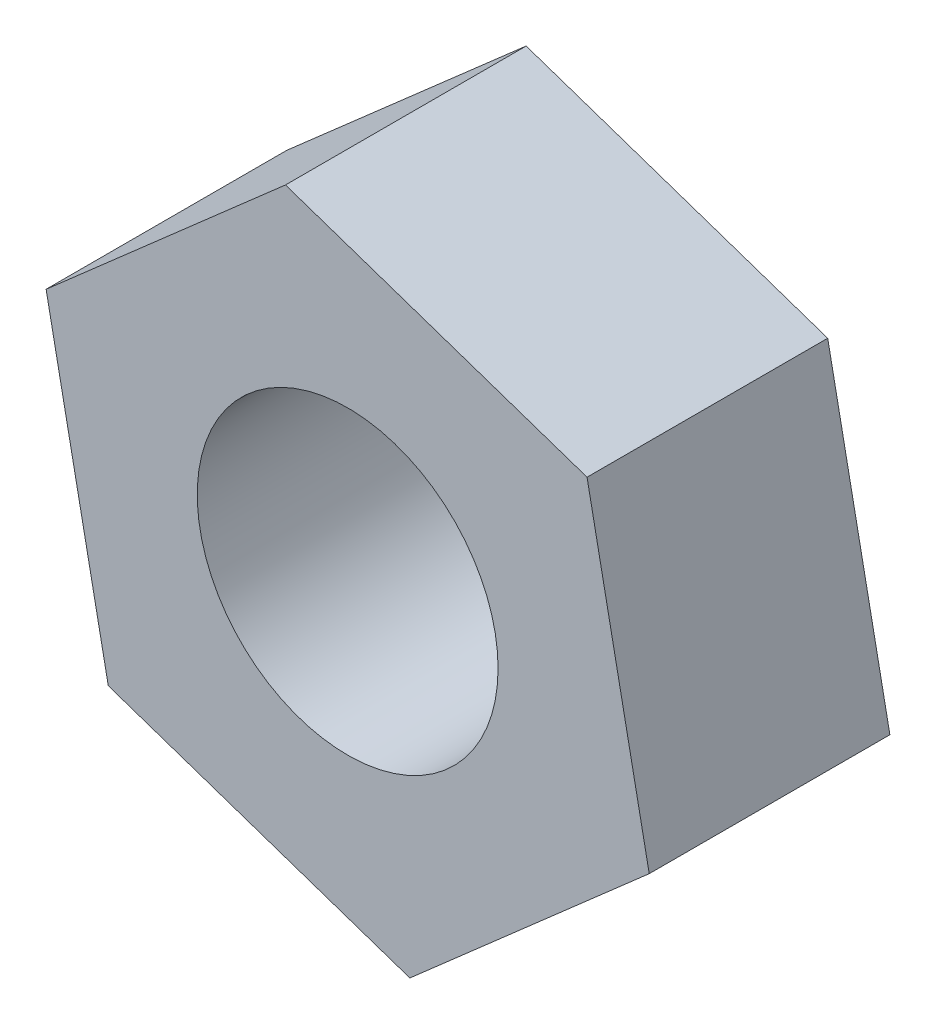
ISO-10303-21;
HEADER;
FILE_DESCRIPTION(('STEP AP214'),'2;1');
FILE_NAME('part.step','',(''),(''),'','','');
FILE_SCHEMA(('AUTOMOTIVE_DESIGN { 1 0 10303 214 1 1 1 1 }'));
ENDSEC;
DATA;
#1=APPLICATION_CONTEXT('core data for automotive mechanical design processes');
#2=APPLICATION_PROTOCOL_DEFINITION('international standard','automotive_design',2000,#1);
#3=PRODUCT_CONTEXT('',#1,'mechanical');
#4=PRODUCT('Part','Part','',(#3));
#5=PRODUCT_RELATED_PRODUCT_CATEGORY('part','',(#4));
#6=PRODUCT_DEFINITION_FORMATION('','',#4);
#7=PRODUCT_DEFINITION_CONTEXT('part definition',#1,'design');
#8=PRODUCT_DEFINITION('design','',#6,#7);
#9=PRODUCT_DEFINITION_SHAPE('','',#8);
#10=(LENGTH_UNIT() NAMED_UNIT(*) SI_UNIT(.MILLI.,.METRE.));
#11=(NAMED_UNIT(*) PLANE_ANGLE_UNIT() SI_UNIT($,.RADIAN.));
#12=(NAMED_UNIT(*) SI_UNIT($,.STERADIAN.) SOLID_ANGLE_UNIT());
#13=UNCERTAINTY_MEASURE_WITH_UNIT(LENGTH_MEASURE(1.E-05),#10,'distance_accuracy_value','');
#14=(GEOMETRIC_REPRESENTATION_CONTEXT(3) GLOBAL_UNCERTAINTY_ASSIGNED_CONTEXT((#13)) GLOBAL_UNIT_ASSIGNED_CONTEXT((#10,
#11,#12)) REPRESENTATION_CONTEXT('',''));
#15=CARTESIAN_POINT('',(0.,0.,0.));
#16=DIRECTION('',(0.,0.,1.));
#17=DIRECTION('',(1.,0.,0.));
#18=AXIS2_PLACEMENT_3D('',#15,#16,#17);
#19=CARTESIAN_POINT('',(0.,0.,2.4));
#20=DIRECTION('',(0.,0.,1.));
#21=DIRECTION('',(1.,0.,0.));
#22=AXIS2_PLACEMENT_3D('',#19,#20,#21);
#23=PLANE('',#22);
#24=DIRECTION('',(0.751714336104161,0.659488860327057,0.));
#25=VECTOR('',#24,1.);
#26=CARTESIAN_POINT('',(0.620087561564956,-3.11429361963925,2.4));
#27=LINE('',#26,#25);
#28=CARTESIAN_POINT('',(0.620087561564956,-3.11429361963925,2.4));
#29=VERTEX_POINT('',#28);
#30=CARTESIAN_POINT('',(3.00710117023386,-1.02013522893363,2.4));
#31=VERTEX_POINT('',#30);
#32=EDGE_CURVE('E130',#29,#31,#27,.T.);
#33=ORIENTED_EDGE('',*,*,#32,.T.);
#34=DIRECTION('',(-0.195276938503999,0.980748141618686,0.));
#35=VECTOR('',#34,1.);
#36=CARTESIAN_POINT('',(3.00710117023386,-1.02013522893363,2.4));
#37=LINE('',#36,#35);
#38=CARTESIAN_POINT('',(2.38701360866891,2.09415839070562,2.4));
#39=VERTEX_POINT('',#38);
#40=EDGE_CURVE('E88',#31,#39,#37,.T.);
#41=ORIENTED_EDGE('',*,*,#40,.T.);
#42=DIRECTION('',(-0.94699127460816,0.321259281291628,0.));
#43=VECTOR('',#42,1.);
#44=CARTESIAN_POINT('',(2.38701360866891,2.09415839070562,2.4));
#45=LINE('',#44,#43);
#46=CARTESIAN_POINT('',(-0.620087561564952,3.11429361963925,2.4));
#47=VERTEX_POINT('',#46);
#48=EDGE_CURVE('E101',#39,#47,#45,.T.);
#49=ORIENTED_EDGE('',*,*,#48,.T.);
#50=DIRECTION('',(-0.751714336104161,-0.659488860327057,0.));
#51=VECTOR('',#50,1.);
#52=CARTESIAN_POINT('',(-0.620087561564952,3.11429361963925,2.4));
#53=LINE('',#52,#51);
#54=CARTESIAN_POINT('',(-3.00710117023386,1.02013522893363,2.4));
#55=VERTEX_POINT('',#54);
#56=EDGE_CURVE('E95',#47,#55,#53,.T.);
#57=ORIENTED_EDGE('',*,*,#56,.T.);
#58=DIRECTION('',(0.195276938503999,-0.980748141618686,0.));
#59=VECTOR('',#58,1.);
#60=CARTESIAN_POINT('',(-3.00710117023386,1.02013522893363,2.4));
#61=LINE('',#60,#59);
#62=CARTESIAN_POINT('',(-2.38701360866891,-2.09415839070562,2.4));
#63=VERTEX_POINT('',#62);
#64=EDGE_CURVE('E99',#55,#63,#61,.T.);
#65=ORIENTED_EDGE('',*,*,#64,.T.);
#66=DIRECTION('',(0.94699127460816,-0.321259281291628,0.));
#67=VECTOR('',#66,1.);
#68=CARTESIAN_POINT('',(-2.38701360866891,-2.09415839070562,2.4));
#69=LINE('',#68,#67);
#70=EDGE_CURVE('E51',#63,#29,#69,.T.);
#71=ORIENTED_EDGE('',*,*,#70,.T.);
#72=EDGE_LOOP('',(#33,#41,#49,#57,#65,#71));
#73=FACE_BOUND('',#72,.T.);
#74=CARTESIAN_POINT('',(0.,0.,2.4));
#75=DIRECTION('',(0.,0.,1.));
#76=DIRECTION('',(1.,0.,0.));
#77=AXIS2_PLACEMENT_3D('',#74,#75,#76);
#78=CIRCLE('',#77,1.5);
#79=CARTESIAN_POINT('',(1.5,0.,2.4));
#80=VERTEX_POINT('',#79);
#81=EDGE_CURVE('E123',#80,#80,#78,.T.);
#82=ORIENTED_EDGE('',*,*,#81,.F.);
#83=EDGE_LOOP('',(#82));
#84=FACE_BOUND('',#83,.T.);
#85=ADVANCED_FACE('F34',(#73,#84),#23,.T.);
#86=CARTESIAN_POINT('',(0.,0.,0.));
#87=DIRECTION('',(0.,0.,1.));
#88=DIRECTION('',(1.,0.,0.));
#89=AXIS2_PLACEMENT_3D('',#86,#87,#88);
#90=PLANE('',#89);
#91=DIRECTION('',(0.751714336104161,0.659488860327057,0.));
#92=VECTOR('',#91,1.);
#93=CARTESIAN_POINT('',(0.620087561564956,-3.11429361963925,0.));
#94=LINE('',#93,#92);
#95=CARTESIAN_POINT('',(0.620087561564956,-3.11429361963925,0.));
#96=VERTEX_POINT('',#95);
#97=CARTESIAN_POINT('',(3.00710117023386,-1.02013522893363,0.));
#98=VERTEX_POINT('',#97);
#99=EDGE_CURVE('E119',#96,#98,#94,.T.);
#100=ORIENTED_EDGE('',*,*,#99,.F.);
#101=DIRECTION('',(0.94699127460816,-0.321259281291628,0.));
#102=VECTOR('',#101,1.);
#103=CARTESIAN_POINT('',(-2.38701360866891,-2.09415839070562,0.));
#104=LINE('',#103,#102);
#105=CARTESIAN_POINT('',(-2.38701360866891,-2.09415839070562,0.));
#106=VERTEX_POINT('',#105);
#107=EDGE_CURVE('E80',#106,#96,#104,.T.);
#108=ORIENTED_EDGE('',*,*,#107,.F.);
#109=DIRECTION('',(0.195276938503999,-0.980748141618686,0.));
#110=VECTOR('',#109,1.);
#111=CARTESIAN_POINT('',(-3.00710117023386,1.02013522893363,0.));
#112=LINE('',#111,#110);
#113=CARTESIAN_POINT('',(-3.00710117023386,1.02013522893363,0.));
#114=VERTEX_POINT('',#113);
#115=EDGE_CURVE('E74',#114,#106,#112,.T.);
#116=ORIENTED_EDGE('',*,*,#115,.F.);
#117=DIRECTION('',(-0.751714336104161,-0.659488860327057,0.));
#118=VECTOR('',#117,1.);
#119=CARTESIAN_POINT('',(-0.620087561564952,3.11429361963925,0.));
#120=LINE('',#119,#118);
#121=CARTESIAN_POINT('',(-0.620087561564952,3.11429361963925,0.));
#122=VERTEX_POINT('',#121);
#123=EDGE_CURVE('E109',#122,#114,#120,.T.);
#124=ORIENTED_EDGE('',*,*,#123,.F.);
#125=DIRECTION('',(-0.94699127460816,0.321259281291628,0.));
#126=VECTOR('',#125,1.);
#127=CARTESIAN_POINT('',(2.38701360866891,2.09415839070562,0.));
#128=LINE('',#127,#126);
#129=CARTESIAN_POINT('',(2.38701360866891,2.09415839070562,0.));
#130=VERTEX_POINT('',#129);
#131=EDGE_CURVE('E125',#130,#122,#128,.T.);
#132=ORIENTED_EDGE('',*,*,#131,.F.);
#133=DIRECTION('',(-0.195276938503999,0.980748141618686,0.));
#134=VECTOR('',#133,1.);
#135=CARTESIAN_POINT('',(3.00710117023386,-1.02013522893363,0.));
#136=LINE('',#135,#134);
#137=EDGE_CURVE('E122',#98,#130,#136,.T.);
#138=ORIENTED_EDGE('',*,*,#137,.F.);
#139=EDGE_LOOP('',(#100,#108,#116,#124,#132,#138));
#140=FACE_BOUND('',#139,.T.);
#141=CARTESIAN_POINT('',(0.,0.,0.));
#142=DIRECTION('',(0.,0.,1.));
#143=DIRECTION('',(1.,0.,0.));
#144=AXIS2_PLACEMENT_3D('',#141,#142,#143);
#145=CIRCLE('',#144,1.5);
#146=CARTESIAN_POINT('',(1.5,0.,0.));
#147=VERTEX_POINT('',#146);
#148=EDGE_CURVE('E223',#147,#147,#145,.T.);
#149=ORIENTED_EDGE('',*,*,#148,.T.);
#150=EDGE_LOOP('',(#149));
#151=FACE_BOUND('',#150,.T.);
#152=ADVANCED_FACE('F139',(#140,#151),#90,.F.);
#153=CARTESIAN_POINT('',(0.620087561564956,-3.11429361963925,2.4));
#154=DIRECTION('',(-0.659488860327057,0.751714336104161,0.));
#155=DIRECTION('',(-0.751714336104161,-0.659488860327057,0.));
#156=AXIS2_PLACEMENT_3D('',#153,#154,#155);
#157=PLANE('',#156);
#158=ORIENTED_EDGE('',*,*,#99,.T.);
#159=DIRECTION('',(0.,0.,-1.));
#160=VECTOR('',#159,1.);
#161=CARTESIAN_POINT('',(3.00710117023386,-1.02013522893363,2.4));
#162=LINE('',#161,#160);
#163=EDGE_CURVE('E11',#31,#98,#162,.T.);
#164=ORIENTED_EDGE('',*,*,#163,.F.);
#165=ORIENTED_EDGE('',*,*,#32,.F.);
#166=DIRECTION('',(0.,0.,-1.));
#167=VECTOR('',#166,1.);
#168=CARTESIAN_POINT('',(0.620087561564956,-3.11429361963925,2.4));
#169=LINE('',#168,#167);
#170=EDGE_CURVE('E115',#29,#96,#169,.T.);
#171=ORIENTED_EDGE('',*,*,#170,.T.);
#172=EDGE_LOOP('',(#158,#164,#165,#171));
#173=FACE_BOUND('',#172,.T.);
#174=ADVANCED_FACE('F36',(#173),#157,.F.);
#175=CARTESIAN_POINT('',(3.00710117023386,-1.02013522893363,2.4));
#176=DIRECTION('',(-0.980748141618686,-0.195276938503999,0.));
#177=DIRECTION('',(0.195276938503999,-0.980748141618686,0.));
#178=AXIS2_PLACEMENT_3D('',#175,#176,#177);
#179=PLANE('',#178);
#180=ORIENTED_EDGE('',*,*,#137,.T.);
#181=DIRECTION('',(0.,0.,-1.));
#182=VECTOR('',#181,1.);
#183=CARTESIAN_POINT('',(2.38701360866891,2.09415839070562,2.4));
#184=LINE('',#183,#182);
#185=EDGE_CURVE('E43',#39,#130,#184,.T.);
#186=ORIENTED_EDGE('',*,*,#185,.F.);
#187=ORIENTED_EDGE('',*,*,#40,.F.);
#188=ORIENTED_EDGE('',*,*,#163,.T.);
#189=EDGE_LOOP('',(#180,#186,#187,#188));
#190=FACE_BOUND('',#189,.T.);
#191=ADVANCED_FACE('F164',(#190),#179,.F.);
#192=CARTESIAN_POINT('',(2.38701360866891,2.09415839070562,2.4));
#193=DIRECTION('',(-0.321259281291628,-0.946991274608159,0.));
#194=DIRECTION('',(0.94699127460816,-0.321259281291628,0.));
#195=AXIS2_PLACEMENT_3D('',#192,#193,#194);
#196=PLANE('',#195);
#197=ORIENTED_EDGE('',*,*,#131,.T.);
#198=DIRECTION('',(0.,0.,-1.));
#199=VECTOR('',#198,1.);
#200=CARTESIAN_POINT('',(-0.620087561564952,3.11429361963925,2.4));
#201=LINE('',#200,#199);
#202=EDGE_CURVE('E110',#47,#122,#201,.T.);
#203=ORIENTED_EDGE('',*,*,#202,.F.);
#204=ORIENTED_EDGE('',*,*,#48,.F.);
#205=ORIENTED_EDGE('',*,*,#185,.T.);
#206=EDGE_LOOP('',(#197,#203,#204,#205));
#207=FACE_BOUND('',#206,.T.);
#208=ADVANCED_FACE('F136',(#207),#196,.F.);
#209=CARTESIAN_POINT('',(-0.620087561564952,3.11429361963925,2.4));
#210=DIRECTION('',(0.659488860327057,-0.751714336104161,0.));
#211=DIRECTION('',(0.751714336104161,0.659488860327057,0.));
#212=AXIS2_PLACEMENT_3D('',#209,#210,#211);
#213=PLANE('',#212);
#214=ORIENTED_EDGE('',*,*,#123,.T.);
#215=DIRECTION('',(0.,0.,-1.));
#216=VECTOR('',#215,1.);
#217=CARTESIAN_POINT('',(-3.00710117023386,1.02013522893363,2.4));
#218=LINE('',#217,#216);
#219=EDGE_CURVE('E106',#55,#114,#218,.T.);
#220=ORIENTED_EDGE('',*,*,#219,.F.);
#221=ORIENTED_EDGE('',*,*,#56,.F.);
#222=ORIENTED_EDGE('',*,*,#202,.T.);
#223=EDGE_LOOP('',(#214,#220,#221,#222));
#224=FACE_BOUND('',#223,.T.);
#225=ADVANCED_FACE('F107',(#224),#213,.F.);
#226=CARTESIAN_POINT('',(-3.00710117023386,1.02013522893363,2.4));
#227=DIRECTION('',(0.980748141618686,0.195276938503999,0.));
#228=DIRECTION('',(-0.195276938503999,0.980748141618686,0.));
#229=AXIS2_PLACEMENT_3D('',#226,#227,#228);
#230=PLANE('',#229);
#231=ORIENTED_EDGE('',*,*,#115,.T.);
#232=DIRECTION('',(0.,0.,-1.));
#233=VECTOR('',#232,1.);
#234=CARTESIAN_POINT('',(-2.38701360866891,-2.09415839070562,2.4));
#235=LINE('',#234,#233);
#236=EDGE_CURVE('E111',#63,#106,#235,.T.);
#237=ORIENTED_EDGE('',*,*,#236,.F.);
#238=ORIENTED_EDGE('',*,*,#64,.F.);
#239=ORIENTED_EDGE('',*,*,#219,.T.);
#240=EDGE_LOOP('',(#231,#237,#238,#239));
#241=FACE_BOUND('',#240,.T.);
#242=ADVANCED_FACE('F113',(#241),#230,.F.);
#243=CARTESIAN_POINT('',(-2.38701360866891,-2.09415839070562,2.4));
#244=DIRECTION('',(0.321259281291628,0.946991274608159,0.));
#245=DIRECTION('',(-0.94699127460816,0.321259281291628,0.));
#246=AXIS2_PLACEMENT_3D('',#243,#244,#245);
#247=PLANE('',#246);
#248=ORIENTED_EDGE('',*,*,#107,.T.);
#249=ORIENTED_EDGE('',*,*,#170,.F.);
#250=ORIENTED_EDGE('',*,*,#70,.F.);
#251=ORIENTED_EDGE('',*,*,#236,.T.);
#252=EDGE_LOOP('',(#248,#249,#250,#251));
#253=FACE_BOUND('',#252,.T.);
#254=ADVANCED_FACE('F144',(#253),#247,.F.);
#255=CARTESIAN_POINT('',(0.,0.,2.4));
#256=DIRECTION('',(0.,0.,-1.));
#257=DIRECTION('',(-1.,0.,0.));
#258=AXIS2_PLACEMENT_3D('',#255,#256,#257);
#259=CYLINDRICAL_SURFACE('',#258,1.5);
#260=ORIENTED_EDGE('',*,*,#81,.T.);
#261=EDGE_LOOP('',(#260));
#262=FACE_BOUND('',#261,.T.);
#263=ORIENTED_EDGE('',*,*,#148,.F.);
#264=EDGE_LOOP('',(#263));
#265=FACE_BOUND('',#264,.T.);
#266=ADVANCED_FACE('F146',(#262,#265),#259,.F.);
#267=CLOSED_SHELL('',(#85,#152,#174,#191,#208,#225,#242,#254,#266));
#268=MANIFOLD_SOLID_BREP('B2',#267);
#269=ADVANCED_BREP_SHAPE_REPRESENTATION('',(#18,#268),#14);
#270=SHAPE_DEFINITION_REPRESENTATION(#9,#269);
ENDSEC;
END-ISO-10303-21;
